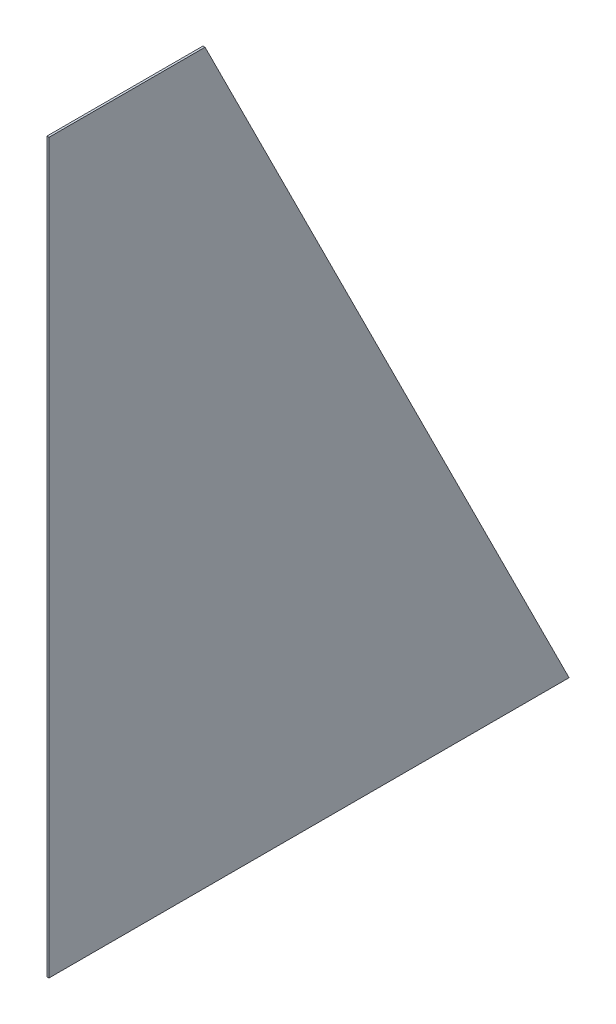
ISO-10303-21;
HEADER;
FILE_DESCRIPTION(('STEP AP214'),'2;1');
FILE_NAME('part.step','',(''),(''),'','','');
FILE_SCHEMA(('AUTOMOTIVE_DESIGN { 1 0 10303 214 1 1 1 1 }'));
ENDSEC;
DATA;
#1=APPLICATION_CONTEXT('core data for automotive mechanical design processes');
#2=APPLICATION_PROTOCOL_DEFINITION('international standard','automotive_design',2000,#1);
#3=PRODUCT_CONTEXT('',#1,'mechanical');
#4=PRODUCT('Part','Part','',(#3));
#5=PRODUCT_RELATED_PRODUCT_CATEGORY('part','',(#4));
#6=PRODUCT_DEFINITION_FORMATION('','',#4);
#7=PRODUCT_DEFINITION_CONTEXT('part definition',#1,'design');
#8=PRODUCT_DEFINITION('design','',#6,#7);
#9=PRODUCT_DEFINITION_SHAPE('','',#8);
#10=(LENGTH_UNIT() NAMED_UNIT(*) SI_UNIT(.MILLI.,.METRE.));
#11=(NAMED_UNIT(*) PLANE_ANGLE_UNIT() SI_UNIT($,.RADIAN.));
#12=(NAMED_UNIT(*) SI_UNIT($,.STERADIAN.) SOLID_ANGLE_UNIT());
#13=UNCERTAINTY_MEASURE_WITH_UNIT(LENGTH_MEASURE(1.E-05),#10,'distance_accuracy_value','');
#14=(GEOMETRIC_REPRESENTATION_CONTEXT(3) GLOBAL_UNCERTAINTY_ASSIGNED_CONTEXT((#13)) GLOBAL_UNIT_ASSIGNED_CONTEXT((#10,
#11,#12)) REPRESENTATION_CONTEXT('',''));
#15=CARTESIAN_POINT('',(0.,0.,0.));
#16=DIRECTION('',(0.,0.,1.));
#17=DIRECTION('',(1.,0.,0.));
#18=AXIS2_PLACEMENT_3D('',#15,#16,#17);
#19=CARTESIAN_POINT('',(-1.,0.,-500.));
#20=DIRECTION('',(0.,-1.,0.));
#21=DIRECTION('',(0.,0.,-1.));
#22=AXIS2_PLACEMENT_3D('',#19,#20,#21);
#23=PLANE('',#22);
#24=DIRECTION('',(1.,0.,0.));
#25=VECTOR('',#24,1.);
#26=CARTESIAN_POINT('',(-1.,0.,-500.));
#27=LINE('',#26,#25);
#28=CARTESIAN_POINT('',(-1.,0.,-500.));
#29=VERTEX_POINT('',#28);
#30=CARTESIAN_POINT('',(1.,0.,-500.));
#31=VERTEX_POINT('',#30);
#32=EDGE_CURVE('E36',#29,#31,#27,.T.);
#33=ORIENTED_EDGE('',*,*,#32,.T.);
#34=DIRECTION('',(0.,0.,-1.));
#35=VECTOR('',#34,1.);
#36=CARTESIAN_POINT('',(1.,0.,-500.));
#37=LINE('',#36,#35);
#38=CARTESIAN_POINT('',(1.,0.,0.));
#39=VERTEX_POINT('',#38);
#40=EDGE_CURVE('E73',#39,#31,#37,.T.);
#41=ORIENTED_EDGE('',*,*,#40,.F.);
#42=DIRECTION('',(1.,0.,0.));
#43=VECTOR('',#42,1.);
#44=CARTESIAN_POINT('',(-1.,0.,0.));
#45=LINE('',#44,#43);
#46=CARTESIAN_POINT('',(-1.,0.,0.));
#47=VERTEX_POINT('',#46);
#48=EDGE_CURVE('E11',#47,#39,#45,.T.);
#49=ORIENTED_EDGE('',*,*,#48,.F.);
#50=DIRECTION('',(0.,0.,-1.));
#51=VECTOR('',#50,1.);
#52=CARTESIAN_POINT('',(-1.,0.,-500.));
#53=LINE('',#52,#51);
#54=EDGE_CURVE('E74',#47,#29,#53,.T.);
#55=ORIENTED_EDGE('',*,*,#54,.T.);
#56=EDGE_LOOP('',(#33,#41,#49,#55));
#57=FACE_BOUND('',#56,.T.);
#58=ADVANCED_FACE('F33',(#57),#23,.T.);
#59=CARTESIAN_POINT('',(-1.,0.,0.));
#60=DIRECTION('',(0.,0.,1.));
#61=DIRECTION('',(1.,0.,0.));
#62=AXIS2_PLACEMENT_3D('',#59,#60,#61);
#63=PLANE('',#62);
#64=ORIENTED_EDGE('',*,*,#48,.T.);
#65=DIRECTION('',(0.,-1.,0.));
#66=VECTOR('',#65,1.);
#67=CARTESIAN_POINT('',(1.,0.,0.));
#68=LINE('',#67,#66);
#69=CARTESIAN_POINT('',(1.,700.,0.));
#70=VERTEX_POINT('',#69);
#71=EDGE_CURVE('E90',#70,#39,#68,.T.);
#72=ORIENTED_EDGE('',*,*,#71,.F.);
#73=DIRECTION('',(1.,0.,0.));
#74=VECTOR('',#73,1.);
#75=CARTESIAN_POINT('',(-1.,700.,0.));
#76=LINE('',#75,#74);
#77=CARTESIAN_POINT('',(-1.,700.,0.));
#78=VERTEX_POINT('',#77);
#79=EDGE_CURVE('E41',#78,#70,#76,.T.);
#80=ORIENTED_EDGE('',*,*,#79,.F.);
#81=DIRECTION('',(0.,-1.,0.));
#82=VECTOR('',#81,1.);
#83=CARTESIAN_POINT('',(-1.,0.,0.));
#84=LINE('',#83,#82);
#85=EDGE_CURVE('E79',#78,#47,#84,.T.);
#86=ORIENTED_EDGE('',*,*,#85,.T.);
#87=EDGE_LOOP('',(#64,#72,#80,#86));
#88=FACE_BOUND('',#87,.T.);
#89=ADVANCED_FACE('F105',(#88),#63,.T.);
#90=CARTESIAN_POINT('',(-1.,700.,0.));
#91=DIRECTION('',(0.,1.,0.));
#92=DIRECTION('',(0.,0.,1.));
#93=AXIS2_PLACEMENT_3D('',#90,#91,#92);
#94=PLANE('',#93);
#95=ORIENTED_EDGE('',*,*,#79,.T.);
#96=DIRECTION('',(0.,0.,1.));
#97=VECTOR('',#96,1.);
#98=CARTESIAN_POINT('',(1.,700.,0.));
#99=LINE('',#98,#97);
#100=CARTESIAN_POINT('',(1.,700.,-150.));
#101=VERTEX_POINT('',#100);
#102=EDGE_CURVE('E86',#101,#70,#99,.T.);
#103=ORIENTED_EDGE('',*,*,#102,.F.);
#104=DIRECTION('',(1.,0.,0.));
#105=VECTOR('',#104,1.);
#106=CARTESIAN_POINT('',(-1.,700.,-150.));
#107=LINE('',#106,#105);
#108=CARTESIAN_POINT('',(-1.,700.,-150.));
#109=VERTEX_POINT('',#108);
#110=EDGE_CURVE('E78',#109,#101,#107,.T.);
#111=ORIENTED_EDGE('',*,*,#110,.F.);
#112=DIRECTION('',(0.,0.,1.));
#113=VECTOR('',#112,1.);
#114=CARTESIAN_POINT('',(-1.,700.,0.));
#115=LINE('',#114,#113);
#116=EDGE_CURVE('E98',#109,#78,#115,.T.);
#117=ORIENTED_EDGE('',*,*,#116,.T.);
#118=EDGE_LOOP('',(#95,#103,#111,#117));
#119=FACE_BOUND('',#118,.T.);
#120=ADVANCED_FACE('F102',(#119),#94,.T.);
#121=CARTESIAN_POINT('',(-1.,700.,-150.));
#122=DIRECTION('',(0.,0.447213595499958,-0.894427190999916));
#123=DIRECTION('',(0.,0.894427190999916,0.447213595499958));
#124=AXIS2_PLACEMENT_3D('',#121,#122,#123);
#125=PLANE('',#124);
#126=ORIENTED_EDGE('',*,*,#110,.T.);
#127=DIRECTION('',(0.,0.894427190999916,0.447213595499958));
#128=VECTOR('',#127,1.);
#129=CARTESIAN_POINT('',(1.,700.,-150.));
#130=LINE('',#129,#128);
#131=EDGE_CURVE('E81',#31,#101,#130,.T.);
#132=ORIENTED_EDGE('',*,*,#131,.F.);
#133=ORIENTED_EDGE('',*,*,#32,.F.);
#134=DIRECTION('',(0.,0.894427190999916,0.447213595499958));
#135=VECTOR('',#134,1.);
#136=CARTESIAN_POINT('',(-1.,700.,-150.));
#137=LINE('',#136,#135);
#138=EDGE_CURVE('E96',#29,#109,#137,.T.);
#139=ORIENTED_EDGE('',*,*,#138,.T.);
#140=EDGE_LOOP('',(#126,#132,#133,#139));
#141=FACE_BOUND('',#140,.T.);
#142=ADVANCED_FACE('F82',(#141),#125,.T.);
#143=CARTESIAN_POINT('',(-1.,0.,0.));
#144=DIRECTION('',(-1.,0.,0.));
#145=DIRECTION('',(0.,0.,1.));
#146=AXIS2_PLACEMENT_3D('',#143,#144,#145);
#147=PLANE('',#146);
#148=ORIENTED_EDGE('',*,*,#54,.F.);
#149=ORIENTED_EDGE('',*,*,#85,.F.);
#150=ORIENTED_EDGE('',*,*,#116,.F.);
#151=ORIENTED_EDGE('',*,*,#138,.F.);
#152=EDGE_LOOP('',(#148,#149,#150,#151));
#153=FACE_BOUND('',#152,.T.);
#154=ADVANCED_FACE('F107',(#153),#147,.T.);
#155=CARTESIAN_POINT('',(1.,0.,0.));
#156=DIRECTION('',(-1.,0.,0.));
#157=DIRECTION('',(0.,0.,1.));
#158=AXIS2_PLACEMENT_3D('',#155,#156,#157);
#159=PLANE('',#158);
#160=ORIENTED_EDGE('',*,*,#40,.T.);
#161=ORIENTED_EDGE('',*,*,#131,.T.);
#162=ORIENTED_EDGE('',*,*,#102,.T.);
#163=ORIENTED_EDGE('',*,*,#71,.T.);
#164=EDGE_LOOP('',(#160,#161,#162,#163));
#165=FACE_BOUND('',#164,.T.);
#166=ADVANCED_FACE('F89',(#165),#159,.F.);
#167=CLOSED_SHELL('',(#58,#89,#120,#142,#154,#166));
#168=MANIFOLD_SOLID_BREP('B2',#167);
#169=ADVANCED_BREP_SHAPE_REPRESENTATION('',(#18,#168),#14);
#170=SHAPE_DEFINITION_REPRESENTATION(#9,#169);
ENDSEC;
END-ISO-10303-21;
